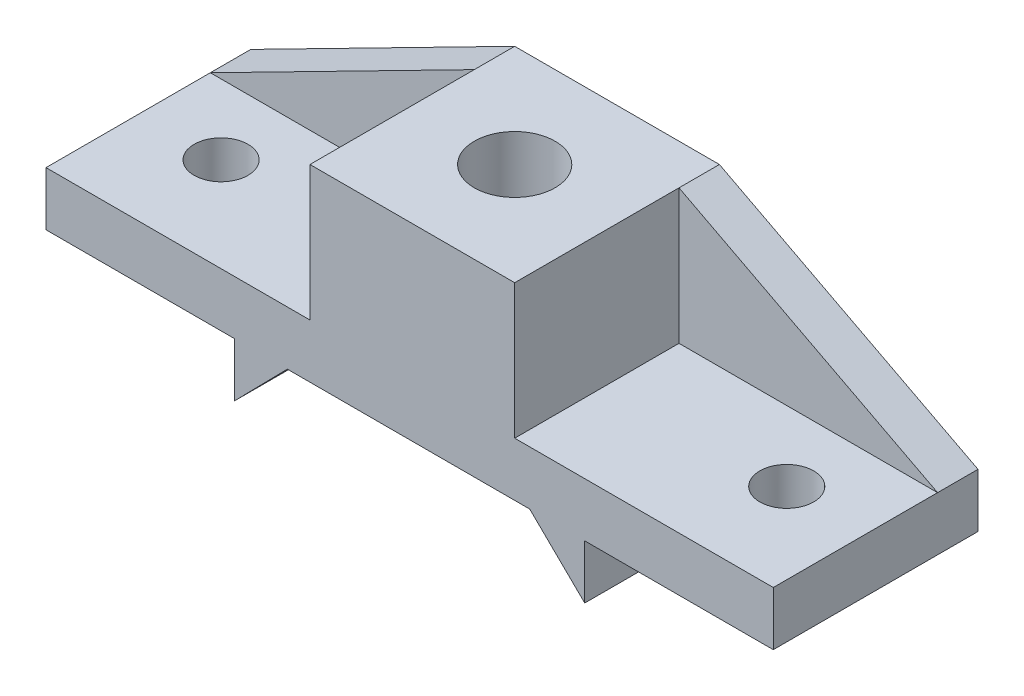
ISO-10303-21;
HEADER;
FILE_DESCRIPTION(('STEP AP214'),'2;1');
FILE_NAME('part.step','',(''),(''),'','','');
FILE_SCHEMA(('AUTOMOTIVE_DESIGN { 1 0 10303 214 1 1 1 1 }'));
ENDSEC;
DATA;
#1=APPLICATION_CONTEXT('core data for automotive mechanical design processes');
#2=APPLICATION_PROTOCOL_DEFINITION('international standard','automotive_design',2000,#1);
#3=PRODUCT_CONTEXT('',#1,'mechanical');
#4=PRODUCT('Part','Part','',(#3));
#5=PRODUCT_RELATED_PRODUCT_CATEGORY('part','',(#4));
#6=PRODUCT_DEFINITION_FORMATION('','',#4);
#7=PRODUCT_DEFINITION_CONTEXT('part definition',#1,'design');
#8=PRODUCT_DEFINITION('design','',#6,#7);
#9=PRODUCT_DEFINITION_SHAPE('','',#8);
#10=(LENGTH_UNIT() NAMED_UNIT(*) SI_UNIT(.MILLI.,.METRE.));
#11=(NAMED_UNIT(*) PLANE_ANGLE_UNIT() SI_UNIT($,.RADIAN.));
#12=(NAMED_UNIT(*) SI_UNIT($,.STERADIAN.) SOLID_ANGLE_UNIT());
#13=UNCERTAINTY_MEASURE_WITH_UNIT(LENGTH_MEASURE(1.E-05),#10,'distance_accuracy_value','');
#14=(GEOMETRIC_REPRESENTATION_CONTEXT(3) GLOBAL_UNCERTAINTY_ASSIGNED_CONTEXT((#13)) GLOBAL_UNIT_ASSIGNED_CONTEXT((#10,
#11,#12)) REPRESENTATION_CONTEXT('',''));
#15=CARTESIAN_POINT('',(0.,0.,0.));
#16=DIRECTION('',(0.,0.,1.));
#17=DIRECTION('',(1.,0.,0.));
#18=AXIS2_PLACEMENT_3D('',#15,#16,#17);
#19=CARTESIAN_POINT('',(327.984556980374,-84.8153530779831,76.));
#20=DIRECTION('',(-0.461934418836969,-0.886914084166979,0.));
#21=DIRECTION('',(0.886914084166979,-0.461934418836969,0.));
#22=AXIS2_PLACEMENT_3D('',#19,#20,#21);
#23=PLANE('',#22);
#24=DIRECTION('',(-0.886914084166979,0.461934418836969,0.));
#25=VECTOR('',#24,1.);
#26=CARTESIAN_POINT('',(327.984556980374,-84.8153530779831,15.));
#27=LINE('',#26,#25);
#28=CARTESIAN_POINT('',(327.984556980374,-84.8153530779831,15.));
#29=VERTEX_POINT('',#28);
#30=CARTESIAN_POINT('',(231.984556980375,-34.8153530779831,15.));
#31=VERTEX_POINT('',#30);
#32=EDGE_CURVE('E310',#29,#31,#27,.T.);
#33=ORIENTED_EDGE('',*,*,#32,.F.);
#34=DIRECTION('',(0.,0.,-1.));
#35=VECTOR('',#34,1.);
#36=CARTESIAN_POINT('',(327.984556980374,-84.8153530779831,76.));
#37=LINE('',#36,#35);
#38=CARTESIAN_POINT('',(327.984556980374,-84.8153530779831,0.));
#39=VERTEX_POINT('',#38);
#40=EDGE_CURVE('E106',#29,#39,#37,.T.);
#41=ORIENTED_EDGE('',*,*,#40,.T.);
#42=DIRECTION('',(-0.886914084166979,0.461934418836969,0.));
#43=VECTOR('',#42,1.);
#44=CARTESIAN_POINT('',(327.984556980374,-84.8153530779831,0.));
#45=LINE('',#44,#43);
#46=CARTESIAN_POINT('',(231.984556980375,-34.8153530779831,0.));
#47=VERTEX_POINT('',#46);
#48=EDGE_CURVE('E216',#39,#47,#45,.T.);
#49=ORIENTED_EDGE('',*,*,#48,.T.);
#50=DIRECTION('',(0.,0.,-1.));
#51=VECTOR('',#50,1.);
#52=CARTESIAN_POINT('',(231.984556980375,-34.8153530779831,76.));
#53=LINE('',#52,#51);
#54=EDGE_CURVE('E113',#31,#47,#53,.T.);
#55=ORIENTED_EDGE('',*,*,#54,.F.);
#56=EDGE_LOOP('',(#33,#41,#49,#55));
#57=FACE_BOUND('',#56,.T.);
#58=ADVANCED_FACE('F43',(#57),#23,.F.);
#59=CARTESIAN_POINT('',(231.984556980375,-34.8153530779831,76.));
#60=DIRECTION('',(0.,-1.,0.));
#61=DIRECTION('',(1.,0.,0.));
#62=AXIS2_PLACEMENT_3D('',#59,#60,#61);
#63=PLANE('',#62);
#64=CARTESIAN_POINT('',(193.984556980375,-34.8153530779831,38.));
#65=DIRECTION('',(0.,1.,0.));
#66=DIRECTION('',(0.,0.,1.));
#67=AXIS2_PLACEMENT_3D('',#64,#65,#66);
#68=CIRCLE('',#67,15.);
#69=CARTESIAN_POINT('',(193.984556980375,-34.8153530779831,53.));
#70=VERTEX_POINT('',#69);
#71=EDGE_CURVE('E275',#70,#70,#68,.T.);
#72=ORIENTED_EDGE('',*,*,#71,.F.);
#73=EDGE_LOOP('',(#72));
#74=FACE_BOUND('',#73,.T.);
#75=DIRECTION('',(-1.,0.,0.));
#76=VECTOR('',#75,1.);
#77=CARTESIAN_POINT('',(231.984556980375,-34.8153530779831,0.));
#78=LINE('',#77,#76);
#79=CARTESIAN_POINT('',(155.984556980374,-34.8153530779831,0.));
#80=VERTEX_POINT('',#79);
#81=EDGE_CURVE('E182',#47,#80,#78,.T.);
#82=ORIENTED_EDGE('',*,*,#81,.T.);
#83=DIRECTION('',(0.,0.,-1.));
#84=VECTOR('',#83,1.);
#85=CARTESIAN_POINT('',(155.984556980374,-34.8153530779831,76.));
#86=LINE('',#85,#84);
#87=CARTESIAN_POINT('',(155.984556980374,-34.8153530779831,15.));
#88=VERTEX_POINT('',#87);
#89=EDGE_CURVE('E54',#88,#80,#86,.T.);
#90=ORIENTED_EDGE('',*,*,#89,.F.);
#91=CARTESIAN_POINT('',(155.984556980374,-34.8153530779831,76.));
#92=VERTEX_POINT('',#91);
#93=EDGE_CURVE('E11',#92,#88,#86,.T.);
#94=ORIENTED_EDGE('',*,*,#93,.F.);
#95=DIRECTION('',(-1.,0.,0.));
#96=VECTOR('',#95,1.);
#97=CARTESIAN_POINT('',(231.984556980375,-34.8153530779831,76.));
#98=LINE('',#97,#96);
#99=CARTESIAN_POINT('',(231.984556980375,-34.8153530779831,76.));
#100=VERTEX_POINT('',#99);
#101=EDGE_CURVE('E219',#100,#92,#98,.T.);
#102=ORIENTED_EDGE('',*,*,#101,.F.);
#103=EDGE_CURVE('E63',#100,#31,#53,.T.);
#104=ORIENTED_EDGE('',*,*,#103,.T.);
#105=ORIENTED_EDGE('',*,*,#54,.T.);
#106=EDGE_LOOP('',(#82,#90,#94,#102,#104,#105));
#107=FACE_BOUND('',#106,.T.);
#108=ADVANCED_FACE('F45',(#74,#107),#63,.F.);
#109=CARTESIAN_POINT('',(155.984556980374,-34.8153530779831,76.));
#110=DIRECTION('',(0.454470341687874,-0.890761869708233,0.));
#111=DIRECTION('',(0.890761869708233,0.454470341687874,0.));
#112=AXIS2_PLACEMENT_3D('',#109,#110,#111);
#113=PLANE('',#112);
#114=DIRECTION('',(0.,0.,-1.));
#115=VECTOR('',#114,1.);
#116=CARTESIAN_POINT('',(57.9845569803746,-84.8153530779831,76.));
#117=LINE('',#116,#115);
#118=CARTESIAN_POINT('',(57.9845569803746,-84.8153530779831,15.));
#119=VERTEX_POINT('',#118);
#120=CARTESIAN_POINT('',(57.9845569803746,-84.8153530779831,0.));
#121=VERTEX_POINT('',#120);
#122=EDGE_CURVE('E250',#119,#121,#117,.T.);
#123=ORIENTED_EDGE('',*,*,#122,.F.);
#124=DIRECTION('',(-0.890761869708233,-0.454470341687874,0.));
#125=VECTOR('',#124,1.);
#126=CARTESIAN_POINT('',(57.9845569803746,-84.8153530779831,15.));
#127=LINE('',#126,#125);
#128=EDGE_CURVE('E279',#88,#119,#127,.T.);
#129=ORIENTED_EDGE('',*,*,#128,.F.);
#130=ORIENTED_EDGE('',*,*,#89,.T.);
#131=DIRECTION('',(-0.890761869708233,-0.454470341687874,0.));
#132=VECTOR('',#131,1.);
#133=CARTESIAN_POINT('',(155.984556980374,-34.8153530779831,0.));
#134=LINE('',#133,#132);
#135=EDGE_CURVE('E185',#80,#121,#134,.T.);
#136=ORIENTED_EDGE('',*,*,#135,.T.);
#137=EDGE_LOOP('',(#123,#129,#130,#136));
#138=FACE_BOUND('',#137,.T.);
#139=ADVANCED_FACE('F394',(#138),#113,.F.);
#140=CARTESIAN_POINT('',(57.9845569803746,-84.8153530779831,76.));
#141=DIRECTION('',(1.,0.,0.));
#142=DIRECTION('',(0.,0.,-1.));
#143=AXIS2_PLACEMENT_3D('',#140,#141,#142);
#144=PLANE('',#143);
#145=DIRECTION('',(0.,-1.,0.));
#146=VECTOR('',#145,1.);
#147=CARTESIAN_POINT('',(57.9845569803746,-84.8153530779831,0.));
#148=LINE('',#147,#146);
#149=CARTESIAN_POINT('',(57.9845569803746,-104.815353077983,0.));
#150=VERTEX_POINT('',#149);
#151=EDGE_CURVE('E190',#121,#150,#148,.T.);
#152=ORIENTED_EDGE('',*,*,#151,.T.);
#153=DIRECTION('',(0.,0.,-1.));
#154=VECTOR('',#153,1.);
#155=CARTESIAN_POINT('',(57.9845569803746,-104.815353077983,76.));
#156=LINE('',#155,#154);
#157=CARTESIAN_POINT('',(57.9845569803746,-104.815353077983,76.));
#158=VERTEX_POINT('',#157);
#159=EDGE_CURVE('E246',#158,#150,#156,.T.);
#160=ORIENTED_EDGE('',*,*,#159,.F.);
#161=DIRECTION('',(0.,-1.,0.));
#162=VECTOR('',#161,1.);
#163=CARTESIAN_POINT('',(57.9845569803746,-84.8153530779831,76.));
#164=LINE('',#163,#162);
#165=CARTESIAN_POINT('',(57.9845569803746,-84.8153530779831,76.));
#166=VERTEX_POINT('',#165);
#167=EDGE_CURVE('E326',#166,#158,#164,.T.);
#168=ORIENTED_EDGE('',*,*,#167,.F.);
#169=EDGE_CURVE('E121',#166,#119,#117,.T.);
#170=ORIENTED_EDGE('',*,*,#169,.T.);
#171=ORIENTED_EDGE('',*,*,#122,.T.);
#172=EDGE_LOOP('',(#152,#160,#168,#170,#171));
#173=FACE_BOUND('',#172,.T.);
#174=ADVANCED_FACE('F421',(#173),#144,.F.);
#175=CARTESIAN_POINT('',(57.9845569803746,-104.815353077983,76.));
#176=DIRECTION('',(0.,1.,0.));
#177=DIRECTION('',(-1.,0.,0.));
#178=AXIS2_PLACEMENT_3D('',#175,#176,#177);
#179=PLANE('',#178);
#180=CARTESIAN_POINT('',(87.9845569803746,-104.815353077983,41.));
#181=DIRECTION('',(0.,1.,0.));
#182=DIRECTION('',(0.,0.,1.));
#183=AXIS2_PLACEMENT_3D('',#180,#181,#182);
#184=CIRCLE('',#183,9.99999999999999);
#185=CARTESIAN_POINT('',(87.9845569803746,-104.815353077983,51.));
#186=VERTEX_POINT('',#185);
#187=EDGE_CURVE('E255',#186,#186,#184,.T.);
#188=ORIENTED_EDGE('',*,*,#187,.T.);
#189=EDGE_LOOP('',(#188));
#190=FACE_BOUND('',#189,.T.);
#191=DIRECTION('',(1.,0.,0.));
#192=VECTOR('',#191,1.);
#193=CARTESIAN_POINT('',(57.9845569803746,-104.815353077983,0.));
#194=LINE('',#193,#192);
#195=CARTESIAN_POINT('',(127.984556980375,-104.815353077983,0.));
#196=VERTEX_POINT('',#195);
#197=EDGE_CURVE('E193',#150,#196,#194,.T.);
#198=ORIENTED_EDGE('',*,*,#197,.T.);
#199=DIRECTION('',(0.,0.,-1.));
#200=VECTOR('',#199,1.);
#201=CARTESIAN_POINT('',(127.984556980375,-104.815353077983,76.));
#202=LINE('',#201,#200);
#203=CARTESIAN_POINT('',(127.984556980375,-104.815353077983,76.));
#204=VERTEX_POINT('',#203);
#205=EDGE_CURVE('E242',#204,#196,#202,.T.);
#206=ORIENTED_EDGE('',*,*,#205,.F.);
#207=DIRECTION('',(1.,0.,0.));
#208=VECTOR('',#207,1.);
#209=CARTESIAN_POINT('',(57.9845569803746,-104.815353077983,76.));
#210=LINE('',#209,#208);
#211=EDGE_CURVE('E329',#158,#204,#210,.T.);
#212=ORIENTED_EDGE('',*,*,#211,.F.);
#213=ORIENTED_EDGE('',*,*,#159,.T.);
#214=EDGE_LOOP('',(#198,#206,#212,#213));
#215=FACE_BOUND('',#214,.T.);
#216=ADVANCED_FACE('F417',(#190,#215),#179,.F.);
#217=CARTESIAN_POINT('',(127.984556980375,-104.815353077983,76.));
#218=DIRECTION('',(1.,0.,0.));
#219=DIRECTION('',(0.,1.,0.));
#220=AXIS2_PLACEMENT_3D('',#217,#218,#219);
#221=PLANE('',#220);
#222=DIRECTION('',(0.,-1.,0.));
#223=VECTOR('',#222,1.);
#224=CARTESIAN_POINT('',(127.984556980375,-104.815353077983,0.));
#225=LINE('',#224,#223);
#226=CARTESIAN_POINT('',(127.984556980375,-124.815353077983,0.));
#227=VERTEX_POINT('',#226);
#228=EDGE_CURVE('E196',#196,#227,#225,.T.);
#229=ORIENTED_EDGE('',*,*,#228,.T.);
#230=DIRECTION('',(0.,0.,-1.));
#231=VECTOR('',#230,1.);
#232=CARTESIAN_POINT('',(127.984556980375,-124.815353077983,76.));
#233=LINE('',#232,#231);
#234=CARTESIAN_POINT('',(127.984556980375,-124.815353077983,76.));
#235=VERTEX_POINT('',#234);
#236=EDGE_CURVE('E238',#235,#227,#233,.T.);
#237=ORIENTED_EDGE('',*,*,#236,.F.);
#238=DIRECTION('',(0.,-1.,0.));
#239=VECTOR('',#238,1.);
#240=CARTESIAN_POINT('',(127.984556980375,-104.815353077983,76.));
#241=LINE('',#240,#239);
#242=EDGE_CURVE('E332',#204,#235,#241,.T.);
#243=ORIENTED_EDGE('',*,*,#242,.F.);
#244=ORIENTED_EDGE('',*,*,#205,.T.);
#245=EDGE_LOOP('',(#229,#237,#243,#244));
#246=FACE_BOUND('',#245,.T.);
#247=ADVANCED_FACE('F413',(#246),#221,.F.);
#248=CARTESIAN_POINT('',(127.984556980375,-124.815353077983,76.));
#249=DIRECTION('',(-0.714212839142521,0.699928582359642,0.));
#250=DIRECTION('',(-0.699928582359643,-0.714212839142522,0.));
#251=AXIS2_PLACEMENT_3D('',#248,#249,#250);
#252=PLANE('',#251);
#253=DIRECTION('',(0.699928582359643,0.714212839142522,0.));
#254=VECTOR('',#253,1.);
#255=CARTESIAN_POINT('',(127.984556980375,-124.815353077983,0.));
#256=LINE('',#255,#254);
#257=CARTESIAN_POINT('',(147.584556980374,-104.815353077983,0.));
#258=VERTEX_POINT('',#257);
#259=EDGE_CURVE('E199',#227,#258,#256,.T.);
#260=ORIENTED_EDGE('',*,*,#259,.T.);
#261=DIRECTION('',(0.,0.,-1.));
#262=VECTOR('',#261,1.);
#263=CARTESIAN_POINT('',(147.584556980374,-104.815353077983,76.));
#264=LINE('',#263,#262);
#265=CARTESIAN_POINT('',(147.584556980374,-104.815353077983,76.));
#266=VERTEX_POINT('',#265);
#267=EDGE_CURVE('E234',#266,#258,#264,.T.);
#268=ORIENTED_EDGE('',*,*,#267,.F.);
#269=DIRECTION('',(0.699928582359643,0.714212839142522,0.));
#270=VECTOR('',#269,1.);
#271=CARTESIAN_POINT('',(127.984556980375,-124.815353077983,76.));
#272=LINE('',#271,#270);
#273=EDGE_CURVE('E335',#235,#266,#272,.T.);
#274=ORIENTED_EDGE('',*,*,#273,.F.);
#275=ORIENTED_EDGE('',*,*,#236,.T.);
#276=EDGE_LOOP('',(#260,#268,#274,#275));
#277=FACE_BOUND('',#276,.T.);
#278=ADVANCED_FACE('F409',(#277),#252,.F.);
#279=CARTESIAN_POINT('',(147.584556980374,-104.815353077983,76.));
#280=DIRECTION('',(0.,1.,0.));
#281=DIRECTION('',(0.,0.,1.));
#282=AXIS2_PLACEMENT_3D('',#279,#280,#281);
#283=PLANE('',#282);
#284=CARTESIAN_POINT('',(193.984556980375,-104.815353077983,38.));
#285=DIRECTION('',(0.,1.,0.));
#286=DIRECTION('',(0.,0.,1.));
#287=AXIS2_PLACEMENT_3D('',#284,#285,#286);
#288=CIRCLE('',#287,15.);
#289=CARTESIAN_POINT('',(193.984556980375,-104.815353077983,53.));
#290=VERTEX_POINT('',#289);
#291=EDGE_CURVE('E269',#290,#290,#288,.T.);
#292=ORIENTED_EDGE('',*,*,#291,.T.);
#293=EDGE_LOOP('',(#292));
#294=FACE_BOUND('',#293,.T.);
#295=DIRECTION('',(1.,0.,0.));
#296=VECTOR('',#295,1.);
#297=CARTESIAN_POINT('',(147.584556980374,-104.815353077983,0.));
#298=LINE('',#297,#296);
#299=CARTESIAN_POINT('',(237.576393715068,-104.815353077983,0.));
#300=VERTEX_POINT('',#299);
#301=EDGE_CURVE('E202',#258,#300,#298,.T.);
#302=ORIENTED_EDGE('',*,*,#301,.T.);
#303=DIRECTION('',(0.,0.,-1.));
#304=VECTOR('',#303,1.);
#305=CARTESIAN_POINT('',(237.576393715068,-104.815353077983,76.));
#306=LINE('',#305,#304);
#307=CARTESIAN_POINT('',(237.576393715068,-104.815353077983,76.));
#308=VERTEX_POINT('',#307);
#309=EDGE_CURVE('E230',#308,#300,#306,.T.);
#310=ORIENTED_EDGE('',*,*,#309,.F.);
#311=DIRECTION('',(1.,0.,0.));
#312=VECTOR('',#311,1.);
#313=CARTESIAN_POINT('',(147.584556980374,-104.815353077983,76.));
#314=LINE('',#313,#312);
#315=EDGE_CURVE('E338',#266,#308,#314,.T.);
#316=ORIENTED_EDGE('',*,*,#315,.F.);
#317=ORIENTED_EDGE('',*,*,#267,.T.);
#318=EDGE_LOOP('',(#302,#310,#316,#317));
#319=FACE_BOUND('',#318,.T.);
#320=ADVANCED_FACE('F346',(#294,#319),#283,.F.);
#321=CARTESIAN_POINT('',(237.576393715068,-104.815353077983,76.));
#322=DIRECTION('',(0.699928582359643,0.714212839142521,0.));
#323=DIRECTION('',(-0.714212839142521,0.699928582359643,0.));
#324=AXIS2_PLACEMENT_3D('',#321,#322,#323);
#325=PLANE('',#324);
#326=DIRECTION('',(0.714212839142521,-0.699928582359643,0.));
#327=VECTOR('',#326,1.);
#328=CARTESIAN_POINT('',(237.576393715068,-104.815353077983,0.));
#329=LINE('',#328,#327);
#330=CARTESIAN_POINT('',(257.984556980375,-124.815353077983,0.));
#331=VERTEX_POINT('',#330);
#332=EDGE_CURVE('E205',#300,#331,#329,.T.);
#333=ORIENTED_EDGE('',*,*,#332,.T.);
#334=DIRECTION('',(0.,0.,-1.));
#335=VECTOR('',#334,1.);
#336=CARTESIAN_POINT('',(257.984556980375,-124.815353077983,76.));
#337=LINE('',#336,#335);
#338=CARTESIAN_POINT('',(257.984556980375,-124.815353077983,76.));
#339=VERTEX_POINT('',#338);
#340=EDGE_CURVE('E169',#339,#331,#337,.T.);
#341=ORIENTED_EDGE('',*,*,#340,.F.);
#342=DIRECTION('',(0.714212839142521,-0.699928582359643,0.));
#343=VECTOR('',#342,1.);
#344=CARTESIAN_POINT('',(237.576393715068,-104.815353077983,76.));
#345=LINE('',#344,#343);
#346=EDGE_CURVE('E155',#308,#339,#345,.T.);
#347=ORIENTED_EDGE('',*,*,#346,.F.);
#348=ORIENTED_EDGE('',*,*,#309,.T.);
#349=EDGE_LOOP('',(#333,#341,#347,#348));
#350=FACE_BOUND('',#349,.T.);
#351=ADVANCED_FACE('F350',(#350),#325,.F.);
#352=CARTESIAN_POINT('',(257.984556980375,-124.815353077983,76.));
#353=DIRECTION('',(-1.,0.,0.));
#354=DIRECTION('',(0.,-1.,0.));
#355=AXIS2_PLACEMENT_3D('',#352,#353,#354);
#356=PLANE('',#355);
#357=DIRECTION('',(0.,1.,0.));
#358=VECTOR('',#357,1.);
#359=CARTESIAN_POINT('',(257.984556980375,-124.815353077983,0.));
#360=LINE('',#359,#358);
#361=CARTESIAN_POINT('',(257.984556980375,-104.815353077983,0.));
#362=VERTEX_POINT('',#361);
#363=EDGE_CURVE('E165',#331,#362,#360,.T.);
#364=ORIENTED_EDGE('',*,*,#363,.T.);
#365=DIRECTION('',(0.,0.,-1.));
#366=VECTOR('',#365,1.);
#367=CARTESIAN_POINT('',(257.984556980375,-104.815353077983,76.));
#368=LINE('',#367,#366);
#369=CARTESIAN_POINT('',(257.984556980375,-104.815353077983,76.));
#370=VERTEX_POINT('',#369);
#371=EDGE_CURVE('E162',#370,#362,#368,.T.);
#372=ORIENTED_EDGE('',*,*,#371,.F.);
#373=DIRECTION('',(0.,1.,0.));
#374=VECTOR('',#373,1.);
#375=CARTESIAN_POINT('',(257.984556980375,-124.815353077983,76.));
#376=LINE('',#375,#374);
#377=EDGE_CURVE('E146',#339,#370,#376,.T.);
#378=ORIENTED_EDGE('',*,*,#377,.F.);
#379=ORIENTED_EDGE('',*,*,#340,.T.);
#380=EDGE_LOOP('',(#364,#372,#378,#379));
#381=FACE_BOUND('',#380,.T.);
#382=ADVANCED_FACE('F163',(#381),#356,.F.);
#383=CARTESIAN_POINT('',(257.984556980375,-104.815353077983,76.));
#384=DIRECTION('',(0.,1.,0.));
#385=DIRECTION('',(0.,0.,1.));
#386=AXIS2_PLACEMENT_3D('',#383,#384,#385);
#387=PLANE('',#386);
#388=CARTESIAN_POINT('',(297.984556980375,-104.815353077983,41.));
#389=DIRECTION('',(0.,1.,0.));
#390=DIRECTION('',(0.,0.,1.));
#391=AXIS2_PLACEMENT_3D('',#388,#389,#390);
#392=CIRCLE('',#391,9.99999999999998);
#393=CARTESIAN_POINT('',(297.984556980375,-104.815353077983,51.));
#394=VERTEX_POINT('',#393);
#395=EDGE_CURVE('E263',#394,#394,#392,.T.);
#396=ORIENTED_EDGE('',*,*,#395,.T.);
#397=EDGE_LOOP('',(#396));
#398=FACE_BOUND('',#397,.T.);
#399=DIRECTION('',(1.,0.,0.));
#400=VECTOR('',#399,1.);
#401=CARTESIAN_POINT('',(257.984556980375,-104.815353077983,0.));
#402=LINE('',#401,#400);
#403=CARTESIAN_POINT('',(327.984556980374,-104.815353077983,0.));
#404=VERTEX_POINT('',#403);
#405=EDGE_CURVE('E210',#362,#404,#402,.T.);
#406=ORIENTED_EDGE('',*,*,#405,.T.);
#407=DIRECTION('',(0.,0.,-1.));
#408=VECTOR('',#407,1.);
#409=CARTESIAN_POINT('',(327.984556980374,-104.815353077983,76.));
#410=LINE('',#409,#408);
#411=CARTESIAN_POINT('',(327.984556980374,-104.815353077983,76.));
#412=VERTEX_POINT('',#411);
#413=EDGE_CURVE('E170',#412,#404,#410,.T.);
#414=ORIENTED_EDGE('',*,*,#413,.F.);
#415=DIRECTION('',(1.,0.,0.));
#416=VECTOR('',#415,1.);
#417=CARTESIAN_POINT('',(257.984556980375,-104.815353077983,76.));
#418=LINE('',#417,#416);
#419=EDGE_CURVE('E152',#370,#412,#418,.T.);
#420=ORIENTED_EDGE('',*,*,#419,.F.);
#421=ORIENTED_EDGE('',*,*,#371,.T.);
#422=EDGE_LOOP('',(#406,#414,#420,#421));
#423=FACE_BOUND('',#422,.T.);
#424=ADVANCED_FACE('F172',(#398,#423),#387,.F.);
#425=CARTESIAN_POINT('',(327.984556980374,-104.815353077983,76.));
#426=DIRECTION('',(-1.,0.,0.));
#427=DIRECTION('',(0.,0.,1.));
#428=AXIS2_PLACEMENT_3D('',#425,#426,#427);
#429=PLANE('',#428);
#430=DIRECTION('',(0.,1.,0.));
#431=VECTOR('',#430,1.);
#432=CARTESIAN_POINT('',(327.984556980374,-104.815353077983,0.));
#433=LINE('',#432,#431);
#434=EDGE_CURVE('E213',#404,#39,#433,.T.);
#435=ORIENTED_EDGE('',*,*,#434,.T.);
#436=ORIENTED_EDGE('',*,*,#40,.F.);
#437=CARTESIAN_POINT('',(327.984556980374,-84.8153530779831,76.));
#438=VERTEX_POINT('',#437);
#439=EDGE_CURVE('E222',#438,#29,#37,.T.);
#440=ORIENTED_EDGE('',*,*,#439,.F.);
#441=DIRECTION('',(0.,1.,0.));
#442=VECTOR('',#441,1.);
#443=CARTESIAN_POINT('',(327.984556980374,-104.815353077983,76.));
#444=LINE('',#443,#442);
#445=EDGE_CURVE('E176',#412,#438,#444,.T.);
#446=ORIENTED_EDGE('',*,*,#445,.F.);
#447=ORIENTED_EDGE('',*,*,#413,.T.);
#448=EDGE_LOOP('',(#435,#436,#440,#446,#447));
#449=FACE_BOUND('',#448,.T.);
#450=ADVANCED_FACE('F357',(#449),#429,.F.);
#451=CARTESIAN_POINT('',(0.,0.,76.));
#452=DIRECTION('',(0.,0.,1.));
#453=DIRECTION('',(1.,0.,0.));
#454=AXIS2_PLACEMENT_3D('',#451,#452,#453);
#455=PLANE('',#454);
#456=DIRECTION('',(0.,1.,0.));
#457=VECTOR('',#456,1.);
#458=CARTESIAN_POINT('',(155.984556980374,-34.8153530779831,76.));
#459=LINE('',#458,#457);
#460=CARTESIAN_POINT('',(155.984556980374,-84.8153530779831,76.));
#461=VERTEX_POINT('',#460);
#462=EDGE_CURVE('E284',#461,#92,#459,.T.);
#463=ORIENTED_EDGE('',*,*,#462,.F.);
#464=DIRECTION('',(1.,0.,0.));
#465=VECTOR('',#464,1.);
#466=CARTESIAN_POINT('',(155.984556980374,-84.8153530779831,76.));
#467=LINE('',#466,#465);
#468=EDGE_CURVE('E292',#166,#461,#467,.T.);
#469=ORIENTED_EDGE('',*,*,#468,.F.);
#470=ORIENTED_EDGE('',*,*,#167,.T.);
#471=ORIENTED_EDGE('',*,*,#211,.T.);
#472=ORIENTED_EDGE('',*,*,#242,.T.);
#473=ORIENTED_EDGE('',*,*,#273,.T.);
#474=ORIENTED_EDGE('',*,*,#315,.T.);
#475=ORIENTED_EDGE('',*,*,#346,.T.);
#476=ORIENTED_EDGE('',*,*,#377,.T.);
#477=ORIENTED_EDGE('',*,*,#419,.T.);
#478=ORIENTED_EDGE('',*,*,#445,.T.);
#479=DIRECTION('',(1.,0.,0.));
#480=VECTOR('',#479,1.);
#481=CARTESIAN_POINT('',(231.984556980375,-84.8153530779831,76.));
#482=LINE('',#481,#480);
#483=CARTESIAN_POINT('',(231.984556980375,-84.8153530779831,76.));
#484=VERTEX_POINT('',#483);
#485=EDGE_CURVE('E306',#484,#438,#482,.T.);
#486=ORIENTED_EDGE('',*,*,#485,.F.);
#487=DIRECTION('',(0.,-1.,0.));
#488=VECTOR('',#487,1.);
#489=CARTESIAN_POINT('',(231.984556980375,-34.8153530779831,76.));
#490=LINE('',#489,#488);
#491=EDGE_CURVE('E295',#100,#484,#490,.T.);
#492=ORIENTED_EDGE('',*,*,#491,.F.);
#493=ORIENTED_EDGE('',*,*,#101,.T.);
#494=EDGE_LOOP('',(#463,#469,#470,#471,#472,#473,#474,#475,#476,#477,#478,#486,#492,#493));
#495=FACE_BOUND('',#494,.T.);
#496=ADVANCED_FACE('F149',(#495),#455,.T.);
#497=CARTESIAN_POINT('',(0.,0.,0.));
#498=DIRECTION('',(0.,0.,1.));
#499=DIRECTION('',(1.,0.,0.));
#500=AXIS2_PLACEMENT_3D('',#497,#498,#499);
#501=PLANE('',#500);
#502=ORIENTED_EDGE('',*,*,#81,.F.);
#503=ORIENTED_EDGE('',*,*,#48,.F.);
#504=ORIENTED_EDGE('',*,*,#434,.F.);
#505=ORIENTED_EDGE('',*,*,#405,.F.);
#506=ORIENTED_EDGE('',*,*,#363,.F.);
#507=ORIENTED_EDGE('',*,*,#332,.F.);
#508=ORIENTED_EDGE('',*,*,#301,.F.);
#509=ORIENTED_EDGE('',*,*,#259,.F.);
#510=ORIENTED_EDGE('',*,*,#228,.F.);
#511=ORIENTED_EDGE('',*,*,#197,.F.);
#512=ORIENTED_EDGE('',*,*,#151,.F.);
#513=ORIENTED_EDGE('',*,*,#135,.F.);
#514=EDGE_LOOP('',(#502,#503,#504,#505,#506,#507,#508,#509,#510,#511,#512,#513));
#515=FACE_BOUND('',#514,.T.);
#516=ADVANCED_FACE('F353',(#515),#501,.F.);
#517=CARTESIAN_POINT('',(231.984556980375,-84.8153530779831,15.));
#518=DIRECTION('',(0.,-1.,0.));
#519=DIRECTION('',(1.,0.,0.));
#520=AXIS2_PLACEMENT_3D('',#517,#518,#519);
#521=PLANE('',#520);
#522=CARTESIAN_POINT('',(297.984556980375,-84.8153530779831,41.));
#523=DIRECTION('',(0.,-1.,0.));
#524=DIRECTION('',(1.,0.,0.));
#525=AXIS2_PLACEMENT_3D('',#522,#523,#524);
#526=CIRCLE('',#525,9.99999999999998);
#527=CARTESIAN_POINT('',(307.984556980375,-84.8153530779831,41.));
#528=VERTEX_POINT('',#527);
#529=EDGE_CURVE('E47',#528,#528,#526,.F.);
#530=ORIENTED_EDGE('',*,*,#529,.F.);
#531=EDGE_LOOP('',(#530));
#532=FACE_BOUND('',#531,.T.);
#533=ORIENTED_EDGE('',*,*,#485,.T.);
#534=ORIENTED_EDGE('',*,*,#439,.T.);
#535=DIRECTION('',(1.,0.,0.));
#536=VECTOR('',#535,1.);
#537=CARTESIAN_POINT('',(231.984556980375,-84.8153530779831,15.));
#538=LINE('',#537,#536);
#539=CARTESIAN_POINT('',(231.984556980375,-84.8153530779831,15.));
#540=VERTEX_POINT('',#539);
#541=EDGE_CURVE('E305',#540,#29,#538,.T.);
#542=ORIENTED_EDGE('',*,*,#541,.F.);
#543=DIRECTION('',(0.,0.,1.));
#544=VECTOR('',#543,1.);
#545=CARTESIAN_POINT('',(231.984556980375,-84.8153530779831,15.));
#546=LINE('',#545,#544);
#547=EDGE_CURVE('E261',#540,#484,#546,.T.);
#548=ORIENTED_EDGE('',*,*,#547,.T.);
#549=EDGE_LOOP('',(#533,#534,#542,#548));
#550=FACE_BOUND('',#549,.T.);
#551=ADVANCED_FACE('F377',(#532,#550),#521,.F.);
#552=CARTESIAN_POINT('',(231.984556980375,-34.8153530779831,15.));
#553=DIRECTION('',(-1.,0.,0.));
#554=DIRECTION('',(0.,0.,1.));
#555=AXIS2_PLACEMENT_3D('',#552,#553,#554);
#556=PLANE('',#555);
#557=ORIENTED_EDGE('',*,*,#491,.T.);
#558=ORIENTED_EDGE('',*,*,#547,.F.);
#559=DIRECTION('',(0.,-1.,0.));
#560=VECTOR('',#559,1.);
#561=CARTESIAN_POINT('',(231.984556980375,-34.8153530779831,15.));
#562=LINE('',#561,#560);
#563=EDGE_CURVE('E316',#31,#540,#562,.T.);
#564=ORIENTED_EDGE('',*,*,#563,.F.);
#565=ORIENTED_EDGE('',*,*,#103,.F.);
#566=EDGE_LOOP('',(#557,#558,#564,#565));
#567=FACE_BOUND('',#566,.T.);
#568=ADVANCED_FACE('F373',(#567),#556,.F.);
#569=CARTESIAN_POINT('',(0.,0.,15.));
#570=DIRECTION('',(0.,0.,1.));
#571=DIRECTION('',(1.,0.,0.));
#572=AXIS2_PLACEMENT_3D('',#569,#570,#571);
#573=PLANE('',#572);
#574=ORIENTED_EDGE('',*,*,#32,.T.);
#575=ORIENTED_EDGE('',*,*,#563,.T.);
#576=ORIENTED_EDGE('',*,*,#541,.T.);
#577=EDGE_LOOP('',(#574,#575,#576));
#578=FACE_BOUND('',#577,.T.);
#579=ADVANCED_FACE('F376',(#578),#573,.T.);
#580=CARTESIAN_POINT('',(155.984556980374,-34.8153530779831,15.));
#581=DIRECTION('',(1.,0.,0.));
#582=DIRECTION('',(0.,0.,-1.));
#583=AXIS2_PLACEMENT_3D('',#580,#581,#582);
#584=PLANE('',#583);
#585=ORIENTED_EDGE('',*,*,#462,.T.);
#586=ORIENTED_EDGE('',*,*,#93,.T.);
#587=DIRECTION('',(0.,1.,0.));
#588=VECTOR('',#587,1.);
#589=CARTESIAN_POINT('',(155.984556980374,-34.8153530779831,15.));
#590=LINE('',#589,#588);
#591=CARTESIAN_POINT('',(155.984556980374,-84.8153530779831,15.));
#592=VERTEX_POINT('',#591);
#593=EDGE_CURVE('E288',#592,#88,#590,.T.);
#594=ORIENTED_EDGE('',*,*,#593,.F.);
#595=DIRECTION('',(0.,0.,1.));
#596=VECTOR('',#595,1.);
#597=CARTESIAN_POINT('',(155.984556980374,-84.8153530779831,15.));
#598=LINE('',#597,#596);
#599=EDGE_CURVE('E186',#592,#461,#598,.T.);
#600=ORIENTED_EDGE('',*,*,#599,.T.);
#601=EDGE_LOOP('',(#585,#586,#594,#600));
#602=FACE_BOUND('',#601,.T.);
#603=ADVANCED_FACE('F448',(#602),#584,.F.);
#604=CARTESIAN_POINT('',(155.984556980374,-84.8153530779831,15.));
#605=DIRECTION('',(0.,-1.,0.));
#606=DIRECTION('',(1.,0.,0.));
#607=AXIS2_PLACEMENT_3D('',#604,#605,#606);
#608=PLANE('',#607);
#609=CARTESIAN_POINT('',(87.9845569803746,-84.8153530779831,41.));
#610=DIRECTION('',(0.,-1.,0.));
#611=DIRECTION('',(1.,0.,0.));
#612=AXIS2_PLACEMENT_3D('',#609,#610,#611);
#613=CIRCLE('',#612,9.99999999999999);
#614=CARTESIAN_POINT('',(97.9845569803746,-84.8153530779831,41.));
#615=VERTEX_POINT('',#614);
#616=EDGE_CURVE('E252',#615,#615,#613,.F.);
#617=ORIENTED_EDGE('',*,*,#616,.F.);
#618=EDGE_LOOP('',(#617));
#619=FACE_BOUND('',#618,.T.);
#620=ORIENTED_EDGE('',*,*,#468,.T.);
#621=ORIENTED_EDGE('',*,*,#599,.F.);
#622=DIRECTION('',(1.,0.,0.));
#623=VECTOR('',#622,1.);
#624=CARTESIAN_POINT('',(155.984556980374,-84.8153530779831,15.));
#625=LINE('',#624,#623);
#626=EDGE_CURVE('E283',#119,#592,#625,.T.);
#627=ORIENTED_EDGE('',*,*,#626,.F.);
#628=ORIENTED_EDGE('',*,*,#169,.F.);
#629=EDGE_LOOP('',(#620,#621,#627,#628));
#630=FACE_BOUND('',#629,.T.);
#631=ADVANCED_FACE('F442',(#619,#630),#608,.F.);
#632=CARTESIAN_POINT('',(0.,0.,15.));
#633=DIRECTION('',(0.,0.,-1.));
#634=DIRECTION('',(-1.,0.,0.));
#635=AXIS2_PLACEMENT_3D('',#632,#633,#634);
#636=PLANE('',#635);
#637=ORIENTED_EDGE('',*,*,#128,.T.);
#638=ORIENTED_EDGE('',*,*,#626,.T.);
#639=ORIENTED_EDGE('',*,*,#593,.T.);
#640=EDGE_LOOP('',(#637,#638,#639));
#641=FACE_BOUND('',#640,.T.);
#642=ADVANCED_FACE('F451',(#641),#636,.F.);
#643=CARTESIAN_POINT('',(87.9845569803746,-34.8153530779831,41.));
#644=DIRECTION('',(0.,-1.,0.));
#645=DIRECTION('',(0.,0.,-1.));
#646=AXIS2_PLACEMENT_3D('',#643,#644,#645);
#647=CYLINDRICAL_SURFACE('',#646,9.99999999999999);
#648=ORIENTED_EDGE('',*,*,#187,.F.);
#649=EDGE_LOOP('',(#648));
#650=FACE_BOUND('',#649,.T.);
#651=ORIENTED_EDGE('',*,*,#616,.T.);
#652=EDGE_LOOP('',(#651));
#653=FACE_BOUND('',#652,.T.);
#654=ADVANCED_FACE('F453',(#650,#653),#647,.F.);
#655=CARTESIAN_POINT('',(297.984556980375,-34.8153530779831,41.));
#656=DIRECTION('',(0.,-1.,0.));
#657=DIRECTION('',(0.,0.,-1.));
#658=AXIS2_PLACEMENT_3D('',#655,#656,#657);
#659=CYLINDRICAL_SURFACE('',#658,9.99999999999998);
#660=ORIENTED_EDGE('',*,*,#395,.F.);
#661=EDGE_LOOP('',(#660));
#662=FACE_BOUND('',#661,.T.);
#663=ORIENTED_EDGE('',*,*,#529,.T.);
#664=EDGE_LOOP('',(#663));
#665=FACE_BOUND('',#664,.T.);
#666=ADVANCED_FACE('F459',(#662,#665),#659,.F.);
#667=CARTESIAN_POINT('',(193.984556980375,-34.8153530779831,38.));
#668=DIRECTION('',(0.,-1.,0.));
#669=DIRECTION('',(0.,0.,-1.));
#670=AXIS2_PLACEMENT_3D('',#667,#668,#669);
#671=CYLINDRICAL_SURFACE('',#670,15.);
#672=ORIENTED_EDGE('',*,*,#71,.T.);
#673=EDGE_LOOP('',(#672));
#674=FACE_BOUND('',#673,.T.);
#675=ORIENTED_EDGE('',*,*,#291,.F.);
#676=EDGE_LOOP('',(#675));
#677=FACE_BOUND('',#676,.T.);
#678=ADVANCED_FACE('F466',(#674,#677),#671,.F.);
#679=CLOSED_SHELL('',(#58,#108,#139,#174,#216,#247,#278,#320,#351,#382,#424,#450,#496,#516,#551,
#568,#579,#603,#631,#642,#654,#666,#678));
#680=MANIFOLD_SOLID_BREP('B2',#679);
#681=ADVANCED_BREP_SHAPE_REPRESENTATION('',(#18,#680),#14);
#682=SHAPE_DEFINITION_REPRESENTATION(#9,#681);
ENDSEC;
END-ISO-10303-21;
